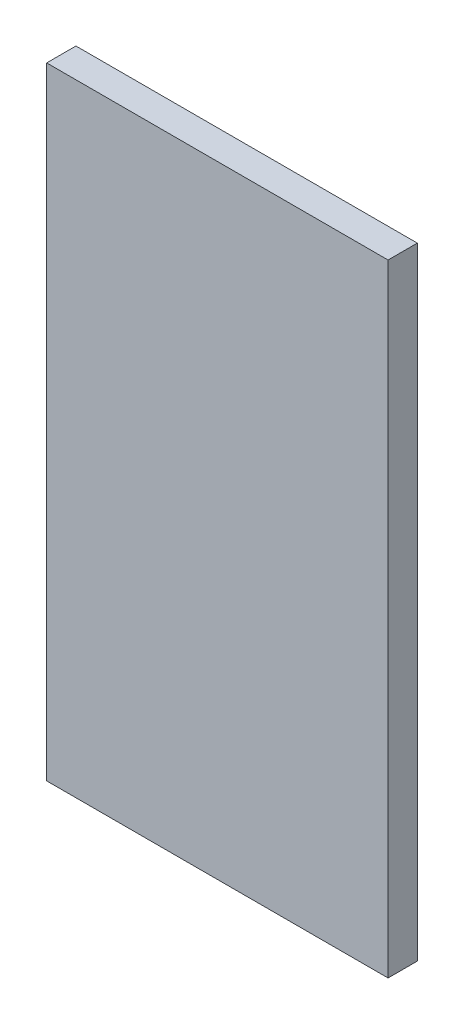
ISO-10303-21;
HEADER;
FILE_DESCRIPTION(('STEP AP214'),'2;1');
FILE_NAME('part.step','',(''),(''),'','','');
FILE_SCHEMA(('AUTOMOTIVE_DESIGN { 1 0 10303 214 1 1 1 1 }'));
ENDSEC;
DATA;
#1=APPLICATION_CONTEXT('core data for automotive mechanical design processes');
#2=APPLICATION_PROTOCOL_DEFINITION('international standard','automotive_design',2000,#1);
#3=PRODUCT_CONTEXT('',#1,'mechanical');
#4=PRODUCT('Part','Part','',(#3));
#5=PRODUCT_RELATED_PRODUCT_CATEGORY('part','',(#4));
#6=PRODUCT_DEFINITION_FORMATION('','',#4);
#7=PRODUCT_DEFINITION_CONTEXT('part definition',#1,'design');
#8=PRODUCT_DEFINITION('design','',#6,#7);
#9=PRODUCT_DEFINITION_SHAPE('','',#8);
#10=(LENGTH_UNIT() NAMED_UNIT(*) SI_UNIT(.MILLI.,.METRE.));
#11=(NAMED_UNIT(*) PLANE_ANGLE_UNIT() SI_UNIT($,.RADIAN.));
#12=(NAMED_UNIT(*) SI_UNIT($,.STERADIAN.) SOLID_ANGLE_UNIT());
#13=UNCERTAINTY_MEASURE_WITH_UNIT(LENGTH_MEASURE(1.E-05),#10,'distance_accuracy_value','');
#14=(GEOMETRIC_REPRESENTATION_CONTEXT(3) GLOBAL_UNCERTAINTY_ASSIGNED_CONTEXT((#13)) GLOBAL_UNIT_ASSIGNED_CONTEXT((#10,
#11,#12)) REPRESENTATION_CONTEXT('',''));
#15=CARTESIAN_POINT('',(0.,0.,0.));
#16=DIRECTION('',(0.,0.,1.));
#17=DIRECTION('',(1.,0.,0.));
#18=AXIS2_PLACEMENT_3D('',#15,#16,#17);
#19=CARTESIAN_POINT('',(-35.,-63.75,6.));
#20=DIRECTION('',(1.,0.,0.));
#21=DIRECTION('',(0.,0.,-1.));
#22=AXIS2_PLACEMENT_3D('',#19,#20,#21);
#23=PLANE('',#22);
#24=DIRECTION('',(0.,-1.,0.));
#25=VECTOR('',#24,1.);
#26=CARTESIAN_POINT('',(-35.,-63.75,0.));
#27=LINE('',#26,#25);
#28=CARTESIAN_POINT('',(-35.,63.75,0.));
#29=VERTEX_POINT('',#28);
#30=CARTESIAN_POINT('',(-35.,-63.75,0.));
#31=VERTEX_POINT('',#30);
#32=EDGE_CURVE('E113',#29,#31,#27,.T.);
#33=ORIENTED_EDGE('',*,*,#32,.T.);
#34=DIRECTION('',(0.,0.,-1.));
#35=VECTOR('',#34,1.);
#36=CARTESIAN_POINT('',(-35.,-63.75,6.));
#37=LINE('',#36,#35);
#38=CARTESIAN_POINT('',(-35.,-63.75,6.));
#39=VERTEX_POINT('',#38);
#40=EDGE_CURVE('E11',#39,#31,#37,.T.);
#41=ORIENTED_EDGE('',*,*,#40,.F.);
#42=DIRECTION('',(0.,-1.,0.));
#43=VECTOR('',#42,1.);
#44=CARTESIAN_POINT('',(-35.,-63.75,6.));
#45=LINE('',#44,#43);
#46=CARTESIAN_POINT('',(-35.,63.75,6.));
#47=VERTEX_POINT('',#46);
#48=EDGE_CURVE('E97',#47,#39,#45,.T.);
#49=ORIENTED_EDGE('',*,*,#48,.F.);
#50=DIRECTION('',(0.,0.,-1.));
#51=VECTOR('',#50,1.);
#52=CARTESIAN_POINT('',(-35.,63.75,6.));
#53=LINE('',#52,#51);
#54=EDGE_CURVE('E109',#47,#29,#53,.T.);
#55=ORIENTED_EDGE('',*,*,#54,.T.);
#56=EDGE_LOOP('',(#33,#41,#49,#55));
#57=FACE_BOUND('',#56,.T.);
#58=ADVANCED_FACE('F45',(#57),#23,.F.);
#59=CARTESIAN_POINT('',(35.,-63.75,6.));
#60=DIRECTION('',(0.,1.,0.));
#61=DIRECTION('',(-1.,0.,0.));
#62=AXIS2_PLACEMENT_3D('',#59,#60,#61);
#63=PLANE('',#62);
#64=DIRECTION('',(1.,0.,0.));
#65=VECTOR('',#64,1.);
#66=CARTESIAN_POINT('',(35.,-63.75,0.));
#67=LINE('',#66,#65);
#68=CARTESIAN_POINT('',(35.,-63.75,0.));
#69=VERTEX_POINT('',#68);
#70=EDGE_CURVE('E102',#31,#69,#67,.T.);
#71=ORIENTED_EDGE('',*,*,#70,.T.);
#72=DIRECTION('',(0.,0.,-1.));
#73=VECTOR('',#72,1.);
#74=CARTESIAN_POINT('',(35.,-63.75,6.));
#75=LINE('',#74,#73);
#76=CARTESIAN_POINT('',(35.,-63.75,6.));
#77=VERTEX_POINT('',#76);
#78=EDGE_CURVE('E54',#77,#69,#75,.T.);
#79=ORIENTED_EDGE('',*,*,#78,.F.);
#80=DIRECTION('',(1.,0.,0.));
#81=VECTOR('',#80,1.);
#82=CARTESIAN_POINT('',(35.,-63.75,6.));
#83=LINE('',#82,#81);
#84=EDGE_CURVE('E92',#39,#77,#83,.T.);
#85=ORIENTED_EDGE('',*,*,#84,.F.);
#86=ORIENTED_EDGE('',*,*,#40,.T.);
#87=EDGE_LOOP('',(#71,#79,#85,#86));
#88=FACE_BOUND('',#87,.T.);
#89=ADVANCED_FACE('F101',(#88),#63,.F.);
#90=CARTESIAN_POINT('',(35.,-63.75,6.));
#91=DIRECTION('',(-1.,0.,0.));
#92=DIRECTION('',(0.,0.,1.));
#93=AXIS2_PLACEMENT_3D('',#90,#91,#92);
#94=PLANE('',#93);
#95=DIRECTION('',(0.,1.,0.));
#96=VECTOR('',#95,1.);
#97=CARTESIAN_POINT('',(35.,-63.75,0.));
#98=LINE('',#97,#96);
#99=CARTESIAN_POINT('',(35.,63.75,0.));
#100=VERTEX_POINT('',#99);
#101=EDGE_CURVE('E79',#69,#100,#98,.T.);
#102=ORIENTED_EDGE('',*,*,#101,.T.);
#103=DIRECTION('',(0.,0.,-1.));
#104=VECTOR('',#103,1.);
#105=CARTESIAN_POINT('',(35.,63.75,6.));
#106=LINE('',#105,#104);
#107=CARTESIAN_POINT('',(35.,63.75,6.));
#108=VERTEX_POINT('',#107);
#109=EDGE_CURVE('E104',#108,#100,#106,.T.);
#110=ORIENTED_EDGE('',*,*,#109,.F.);
#111=DIRECTION('',(0.,1.,0.));
#112=VECTOR('',#111,1.);
#113=CARTESIAN_POINT('',(35.,-63.75,6.));
#114=LINE('',#113,#112);
#115=EDGE_CURVE('E95',#77,#108,#114,.T.);
#116=ORIENTED_EDGE('',*,*,#115,.F.);
#117=ORIENTED_EDGE('',*,*,#78,.T.);
#118=EDGE_LOOP('',(#102,#110,#116,#117));
#119=FACE_BOUND('',#118,.T.);
#120=ADVANCED_FACE('F105',(#119),#94,.F.);
#121=CARTESIAN_POINT('',(35.,63.75,6.));
#122=DIRECTION('',(0.,-1.,0.));
#123=DIRECTION('',(1.,0.,0.));
#124=AXIS2_PLACEMENT_3D('',#121,#122,#123);
#125=PLANE('',#124);
#126=DIRECTION('',(-1.,0.,0.));
#127=VECTOR('',#126,1.);
#128=CARTESIAN_POINT('',(35.,63.75,0.));
#129=LINE('',#128,#127);
#130=EDGE_CURVE('E85',#100,#29,#129,.T.);
#131=ORIENTED_EDGE('',*,*,#130,.T.);
#132=ORIENTED_EDGE('',*,*,#54,.F.);
#133=DIRECTION('',(-1.,0.,0.));
#134=VECTOR('',#133,1.);
#135=CARTESIAN_POINT('',(35.,63.75,6.));
#136=LINE('',#135,#134);
#137=EDGE_CURVE('E62',#108,#47,#136,.T.);
#138=ORIENTED_EDGE('',*,*,#137,.F.);
#139=ORIENTED_EDGE('',*,*,#109,.T.);
#140=EDGE_LOOP('',(#131,#132,#138,#139));
#141=FACE_BOUND('',#140,.T.);
#142=ADVANCED_FACE('F126',(#141),#125,.F.);
#143=CARTESIAN_POINT('',(0.,0.,6.));
#144=DIRECTION('',(0.,0.,1.));
#145=DIRECTION('',(1.,0.,0.));
#146=AXIS2_PLACEMENT_3D('',#143,#144,#145);
#147=PLANE('',#146);
#148=ORIENTED_EDGE('',*,*,#48,.T.);
#149=ORIENTED_EDGE('',*,*,#84,.T.);
#150=ORIENTED_EDGE('',*,*,#115,.T.);
#151=ORIENTED_EDGE('',*,*,#137,.T.);
#152=EDGE_LOOP('',(#148,#149,#150,#151));
#153=FACE_BOUND('',#152,.T.);
#154=ADVANCED_FACE('F93',(#153),#147,.T.);
#155=CARTESIAN_POINT('',(0.,0.,0.));
#156=DIRECTION('',(0.,0.,1.));
#157=DIRECTION('',(1.,0.,0.));
#158=AXIS2_PLACEMENT_3D('',#155,#156,#157);
#159=PLANE('',#158);
#160=ORIENTED_EDGE('',*,*,#32,.F.);
#161=ORIENTED_EDGE('',*,*,#130,.F.);
#162=ORIENTED_EDGE('',*,*,#101,.F.);
#163=ORIENTED_EDGE('',*,*,#70,.F.);
#164=EDGE_LOOP('',(#160,#161,#162,#163));
#165=FACE_BOUND('',#164,.T.);
#166=ADVANCED_FACE('F129',(#165),#159,.F.);
#167=CLOSED_SHELL('',(#58,#89,#120,#142,#154,#166));
#168=MANIFOLD_SOLID_BREP('B2',#167);
#169=ADVANCED_BREP_SHAPE_REPRESENTATION('',(#18,#168),#14);
#170=SHAPE_DEFINITION_REPRESENTATION(#9,#169);
ENDSEC;
END-ISO-10303-21;
